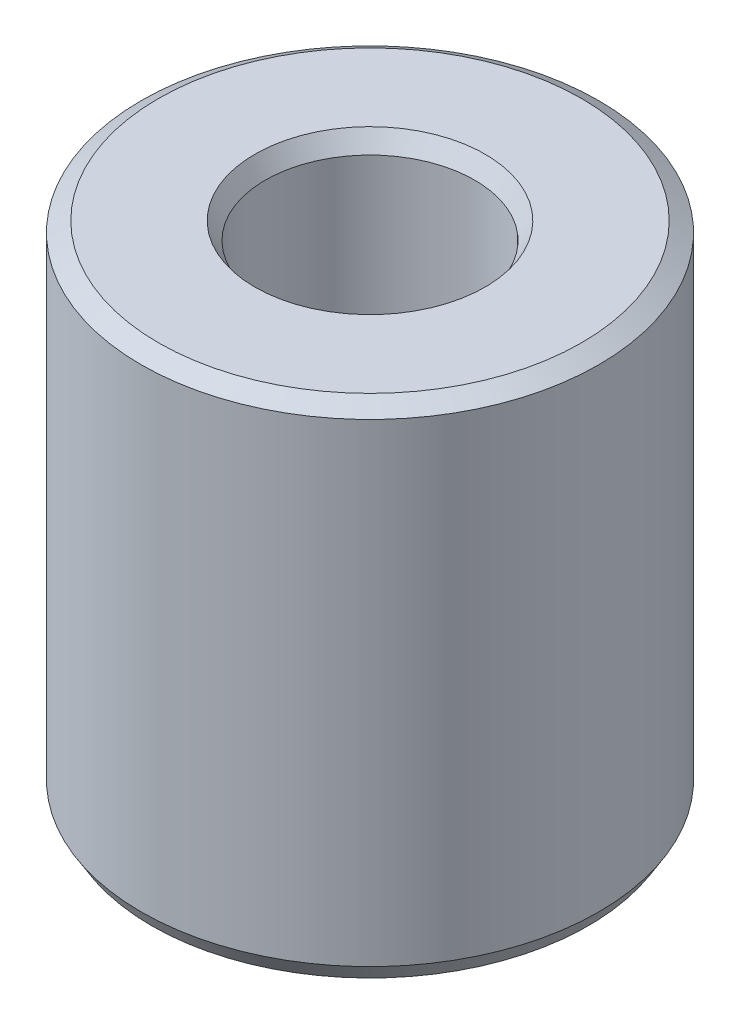
ISO-10303-21;
HEADER;
FILE_DESCRIPTION(('STEP AP214'),'2;1');
FILE_NAME('part.step','',(''),(''),'','','');
FILE_SCHEMA(('AUTOMOTIVE_DESIGN { 1 0 10303 214 1 1 1 1 }'));
ENDSEC;
DATA;
#1=APPLICATION_CONTEXT('core data for automotive mechanical design processes');
#2=APPLICATION_PROTOCOL_DEFINITION('international standard','automotive_design',2000,#1);
#3=PRODUCT_CONTEXT('',#1,'mechanical');
#4=PRODUCT('Part','Part','',(#3));
#5=PRODUCT_RELATED_PRODUCT_CATEGORY('part','',(#4));
#6=PRODUCT_DEFINITION_FORMATION('','',#4);
#7=PRODUCT_DEFINITION_CONTEXT('part definition',#1,'design');
#8=PRODUCT_DEFINITION('design','',#6,#7);
#9=PRODUCT_DEFINITION_SHAPE('','',#8);
#10=(LENGTH_UNIT() NAMED_UNIT(*) SI_UNIT(.MILLI.,.METRE.));
#11=(NAMED_UNIT(*) PLANE_ANGLE_UNIT() SI_UNIT($,.RADIAN.));
#12=(NAMED_UNIT(*) SI_UNIT($,.STERADIAN.) SOLID_ANGLE_UNIT());
#13=UNCERTAINTY_MEASURE_WITH_UNIT(LENGTH_MEASURE(1.E-05),#10,'distance_accuracy_value','');
#14=(GEOMETRIC_REPRESENTATION_CONTEXT(3) GLOBAL_UNCERTAINTY_ASSIGNED_CONTEXT((#13)) GLOBAL_UNIT_ASSIGNED_CONTEXT((#10,
#11,#12)) REPRESENTATION_CONTEXT('',''));
#15=CARTESIAN_POINT('',(0.,0.,0.));
#16=DIRECTION('',(0.,0.,1.));
#17=DIRECTION('',(1.,0.,0.));
#18=AXIS2_PLACEMENT_3D('',#15,#16,#17);
#19=CARTESIAN_POINT('',(0.,60.279143377353,0.));
#20=DIRECTION('',(0.,-1.,0.));
#21=DIRECTION('',(0.,0.,-1.));
#22=AXIS2_PLACEMENT_3D('',#19,#20,#21);
#23=CYLINDRICAL_SURFACE('',#22,27.5);
#24=CARTESIAN_POINT('',(0.,2.06983485944951,0.));
#25=DIRECTION('',(0.,1.,0.));
#26=DIRECTION('',(0.,0.,1.));
#27=AXIS2_PLACEMENT_3D('',#24,#25,#26);
#28=CIRCLE('',#27,27.5);
#29=CARTESIAN_POINT('',(0.,2.06983485944951,27.5));
#30=VERTEX_POINT('',#29);
#31=EDGE_CURVE('E10',#30,#30,#28,.T.);
#32=ORIENTED_EDGE('',*,*,#31,.T.);
#33=EDGE_LOOP('',(#32));
#34=FACE_BOUND('',#33,.T.);
#35=CARTESIAN_POINT('',(0.,59.0267890400984,0.));
#36=DIRECTION('',(0.,1.,0.));
#37=DIRECTION('',(0.,0.,1.));
#38=AXIS2_PLACEMENT_3D('',#35,#36,#37);
#39=CIRCLE('',#38,27.5);
#40=CARTESIAN_POINT('',(0.,59.0267890400984,27.5));
#41=VERTEX_POINT('',#40);
#42=EDGE_CURVE('E50',#41,#41,#39,.F.);
#43=ORIENTED_EDGE('',*,*,#42,.T.);
#44=EDGE_LOOP('',(#43));
#45=FACE_BOUND('',#44,.T.);
#46=ADVANCED_FACE('F39',(#34,#45),#23,.T.);
#47=CARTESIAN_POINT('',(0.,60.279143377353,0.));
#48=DIRECTION('',(0.,1.,0.));
#49=DIRECTION('',(0.,0.,1.));
#50=AXIS2_PLACEMENT_3D('',#47,#48,#49);
#51=PLANE('',#50);
#52=CARTESIAN_POINT('',(0.,60.279143377353,0.));
#53=DIRECTION('',(0.,1.,0.));
#54=DIRECTION('',(0.,0.,1.));
#55=AXIS2_PLACEMENT_3D('',#52,#53,#54);
#56=CIRCLE('',#55,13.8394259879086);
#57=CARTESIAN_POINT('',(0.,60.279143377353,13.8394259879086));
#58=VERTEX_POINT('',#57);
#59=EDGE_CURVE('E58',#58,#58,#56,.F.);
#60=ORIENTED_EDGE('',*,*,#59,.T.);
#61=EDGE_LOOP('',(#60));
#62=FACE_BOUND('',#61,.T.);
#63=CARTESIAN_POINT('',(0.,60.279143377353,0.));
#64=DIRECTION('',(0.,1.,0.));
#65=DIRECTION('',(0.,0.,1.));
#66=AXIS2_PLACEMENT_3D('',#63,#64,#65);
#67=CIRCLE('',#66,25.4301651405504);
#68=CARTESIAN_POINT('',(0.,60.279143377353,25.4301651405504));
#69=VERTEX_POINT('',#68);
#70=EDGE_CURVE('E61',#69,#69,#67,.T.);
#71=ORIENTED_EDGE('',*,*,#70,.T.);
#72=EDGE_LOOP('',(#71));
#73=FACE_BOUND('',#72,.T.);
#74=ADVANCED_FACE('F88',(#62,#73),#51,.T.);
#75=CARTESIAN_POINT('',(0.,0.,0.));
#76=DIRECTION('',(0.,1.,0.));
#77=DIRECTION('',(0.,0.,1.));
#78=AXIS2_PLACEMENT_3D('',#75,#76,#77);
#79=PLANE('',#78);
#80=CARTESIAN_POINT('',(0.,0.,0.));
#81=DIRECTION('',(0.,1.,0.));
#82=DIRECTION('',(0.,0.,1.));
#83=AXIS2_PLACEMENT_3D('',#80,#81,#82);
#84=CIRCLE('',#83,14.6569065101035);
#85=CARTESIAN_POINT('',(0.,0.,14.6569065101035));
#86=VERTEX_POINT('',#85);
#87=EDGE_CURVE('E51',#86,#86,#84,.T.);
#88=ORIENTED_EDGE('',*,*,#87,.T.);
#89=EDGE_LOOP('',(#88));
#90=FACE_BOUND('',#89,.T.);
#91=CARTESIAN_POINT('',(0.,0.,0.));
#92=DIRECTION('',(0.,1.,0.));
#93=DIRECTION('',(0.,0.,1.));
#94=AXIS2_PLACEMENT_3D('',#91,#92,#93);
#95=CIRCLE('',#94,26.2476456627454);
#96=CARTESIAN_POINT('',(0.,0.,26.2476456627454));
#97=VERTEX_POINT('',#96);
#98=EDGE_CURVE('E54',#97,#97,#95,.F.);
#99=ORIENTED_EDGE('',*,*,#98,.T.);
#100=EDGE_LOOP('',(#99));
#101=FACE_BOUND('',#100,.T.);
#102=ADVANCED_FACE('F83',(#90,#101),#79,.F.);
#103=CARTESIAN_POINT('',(0.,60.279143377353,0.));
#104=DIRECTION('',(0.,-1.,0.));
#105=DIRECTION('',(0.,0.,-1.));
#106=AXIS2_PLACEMENT_3D('',#103,#104,#105);
#107=CYLINDRICAL_SURFACE('',#106,12.5870716506539);
#108=CARTESIAN_POINT('',(0.,58.2093085179035,0.));
#109=DIRECTION('',(0.,1.,0.));
#110=DIRECTION('',(0.,0.,1.));
#111=AXIS2_PLACEMENT_3D('',#108,#109,#110);
#112=CIRCLE('',#111,12.5870716506539);
#113=CARTESIAN_POINT('',(0.,58.2093085179035,12.5870716506539));
#114=VERTEX_POINT('',#113);
#115=EDGE_CURVE('E67',#114,#114,#112,.T.);
#116=ORIENTED_EDGE('',*,*,#115,.T.);
#117=EDGE_LOOP('',(#116));
#118=FACE_BOUND('',#117,.T.);
#119=CARTESIAN_POINT('',(0.,1.25235433725466,0.));
#120=DIRECTION('',(0.,1.,0.));
#121=DIRECTION('',(0.,0.,1.));
#122=AXIS2_PLACEMENT_3D('',#119,#120,#121);
#123=CIRCLE('',#122,12.5870716506539);
#124=CARTESIAN_POINT('',(0.,1.25235433725466,12.5870716506539));
#125=VERTEX_POINT('',#124);
#126=EDGE_CURVE('E69',#125,#125,#123,.F.);
#127=ORIENTED_EDGE('',*,*,#126,.T.);
#128=EDGE_LOOP('',(#127));
#129=FACE_BOUND('',#128,.T.);
#130=ADVANCED_FACE('F71',(#118,#129),#107,.F.);
#131=CARTESIAN_POINT('',(0.,58.2093085179035,0.));
#132=DIRECTION('',(0.,1.,0.));
#133=DIRECTION('',(0.,0.,1.));
#134=AXIS2_PLACEMENT_3D('',#131,#132,#133);
#135=CONICAL_SURFACE('',#134,12.5870716506539,0.544124731339107);
#136=ORIENTED_EDGE('',*,*,#59,.F.);
#137=EDGE_LOOP('',(#136));
#138=FACE_BOUND('',#137,.T.);
#139=ORIENTED_EDGE('',*,*,#115,.F.);
#140=EDGE_LOOP('',(#139));
#141=FACE_BOUND('',#140,.T.);
#142=ADVANCED_FACE('F77',(#138,#141),#135,.F.);
#143=CARTESIAN_POINT('',(0.,0.,0.));
#144=DIRECTION('',(0.,-1.,0.));
#145=DIRECTION('',(0.,0.,-1.));
#146=AXIS2_PLACEMENT_3D('',#143,#144,#145);
#147=CONICAL_SURFACE('',#146,14.6569065101035,1.02667159545579);
#148=ORIENTED_EDGE('',*,*,#126,.F.);
#149=EDGE_LOOP('',(#148));
#150=FACE_BOUND('',#149,.T.);
#151=ORIENTED_EDGE('',*,*,#87,.F.);
#152=EDGE_LOOP('',(#151));
#153=FACE_BOUND('',#152,.T.);
#154=ADVANCED_FACE('F73',(#150,#153),#147,.F.);
#155=CARTESIAN_POINT('',(0.,2.06983485944951,0.));
#156=DIRECTION('',(0.,1.,0.));
#157=DIRECTION('',(0.,0.,1.));
#158=AXIS2_PLACEMENT_3D('',#155,#156,#157);
#159=CONICAL_SURFACE('',#158,27.5,0.544124731339106);
#160=ORIENTED_EDGE('',*,*,#98,.F.);
#161=EDGE_LOOP('',(#160));
#162=FACE_BOUND('',#161,.T.);
#163=ORIENTED_EDGE('',*,*,#31,.F.);
#164=EDGE_LOOP('',(#163));
#165=FACE_BOUND('',#164,.T.);
#166=ADVANCED_FACE('F76',(#162,#165),#159,.T.);
#167=CARTESIAN_POINT('',(0.,60.279143377353,0.));
#168=DIRECTION('',(0.,-1.,0.));
#169=DIRECTION('',(0.,0.,-1.));
#170=AXIS2_PLACEMENT_3D('',#167,#168,#169);
#171=CONICAL_SURFACE('',#170,25.4301651405504,1.02667159545579);
#172=ORIENTED_EDGE('',*,*,#42,.F.);
#173=EDGE_LOOP('',(#172));
#174=FACE_BOUND('',#173,.T.);
#175=ORIENTED_EDGE('',*,*,#70,.F.);
#176=EDGE_LOOP('',(#175));
#177=FACE_BOUND('',#176,.T.);
#178=ADVANCED_FACE('F45',(#174,#177),#171,.T.);
#179=CLOSED_SHELL('',(#46,#74,#102,#130,#142,#154,#166,#178));
#180=MANIFOLD_SOLID_BREP('B2',#179);
#181=ADVANCED_BREP_SHAPE_REPRESENTATION('',(#18,#180),#14);
#182=SHAPE_DEFINITION_REPRESENTATION(#9,#181);
ENDSEC;
END-ISO-10303-21;
